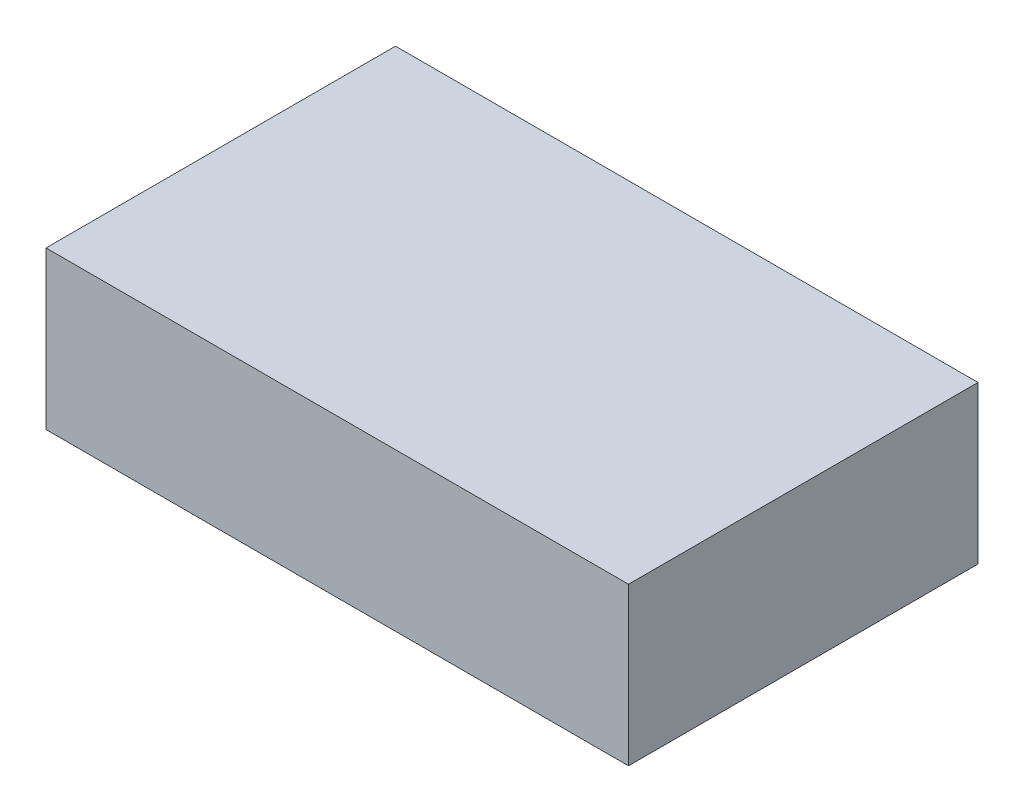
ISO-10303-21;
HEADER;
FILE_DESCRIPTION(('STEP AP214'),'2;1');
FILE_NAME('part.step','',(''),(''),'','','');
FILE_SCHEMA(('AUTOMOTIVE_DESIGN { 1 0 10303 214 1 1 1 1 }'));
ENDSEC;
DATA;
#1=APPLICATION_CONTEXT('core data for automotive mechanical design processes');
#2=APPLICATION_PROTOCOL_DEFINITION('international standard','automotive_design',2000,#1);
#3=PRODUCT_CONTEXT('',#1,'mechanical');
#4=PRODUCT('Part','Part','',(#3));
#5=PRODUCT_RELATED_PRODUCT_CATEGORY('part','',(#4));
#6=PRODUCT_DEFINITION_FORMATION('','',#4);
#7=PRODUCT_DEFINITION_CONTEXT('part definition',#1,'design');
#8=PRODUCT_DEFINITION('design','',#6,#7);
#9=PRODUCT_DEFINITION_SHAPE('','',#8);
#10=(LENGTH_UNIT() NAMED_UNIT(*) SI_UNIT(.MILLI.,.METRE.));
#11=(NAMED_UNIT(*) PLANE_ANGLE_UNIT() SI_UNIT($,.RADIAN.));
#12=(NAMED_UNIT(*) SI_UNIT($,.STERADIAN.) SOLID_ANGLE_UNIT());
#13=UNCERTAINTY_MEASURE_WITH_UNIT(LENGTH_MEASURE(1.E-05),#10,'distance_accuracy_value','');
#14=(GEOMETRIC_REPRESENTATION_CONTEXT(3) GLOBAL_UNCERTAINTY_ASSIGNED_CONTEXT((#13)) GLOBAL_UNIT_ASSIGNED_CONTEXT((#10,
#11,#12)) REPRESENTATION_CONTEXT('',''));
#15=CARTESIAN_POINT('',(0.,0.,0.));
#16=DIRECTION('',(0.,0.,1.));
#17=DIRECTION('',(1.,0.,0.));
#18=AXIS2_PLACEMENT_3D('',#15,#16,#17);
#19=CARTESIAN_POINT('',(5.,2.7,-3.));
#20=DIRECTION('',(-1.,0.,0.));
#21=DIRECTION('',(0.,0.,1.));
#22=AXIS2_PLACEMENT_3D('',#19,#20,#21);
#23=PLANE('',#22);
#24=DIRECTION('',(0.,0.,-1.));
#25=VECTOR('',#24,1.);
#26=CARTESIAN_POINT('',(5.,0.,-3.));
#27=LINE('',#26,#25);
#28=CARTESIAN_POINT('',(5.,0.,3.));
#29=VERTEX_POINT('',#28);
#30=CARTESIAN_POINT('',(5.,0.,-3.));
#31=VERTEX_POINT('',#30);
#32=EDGE_CURVE('E96',#29,#31,#27,.T.);
#33=ORIENTED_EDGE('',*,*,#32,.T.);
#34=DIRECTION('',(0.,-1.,0.));
#35=VECTOR('',#34,1.);
#36=CARTESIAN_POINT('',(5.,2.7,-3.));
#37=LINE('',#36,#35);
#38=CARTESIAN_POINT('',(5.,2.7,-3.));
#39=VERTEX_POINT('',#38);
#40=EDGE_CURVE('E11',#39,#31,#37,.T.);
#41=ORIENTED_EDGE('',*,*,#40,.F.);
#42=DIRECTION('',(0.,0.,-1.));
#43=VECTOR('',#42,1.);
#44=CARTESIAN_POINT('',(5.,2.7,-3.));
#45=LINE('',#44,#43);
#46=CARTESIAN_POINT('',(5.,2.7,3.));
#47=VERTEX_POINT('',#46);
#48=EDGE_CURVE('E84',#47,#39,#45,.T.);
#49=ORIENTED_EDGE('',*,*,#48,.F.);
#50=DIRECTION('',(0.,-1.,0.));
#51=VECTOR('',#50,1.);
#52=CARTESIAN_POINT('',(5.,2.7,3.));
#53=LINE('',#52,#51);
#54=EDGE_CURVE('E92',#47,#29,#53,.T.);
#55=ORIENTED_EDGE('',*,*,#54,.T.);
#56=EDGE_LOOP('',(#33,#41,#49,#55));
#57=FACE_BOUND('',#56,.T.);
#58=ADVANCED_FACE('F33',(#57),#23,.F.);
#59=CARTESIAN_POINT('',(-5.,2.7,-3.));
#60=DIRECTION('',(0.,0.,1.));
#61=DIRECTION('',(1.,0.,0.));
#62=AXIS2_PLACEMENT_3D('',#59,#60,#61);
#63=PLANE('',#62);
#64=DIRECTION('',(-1.,0.,0.));
#65=VECTOR('',#64,1.);
#66=CARTESIAN_POINT('',(-5.,0.,-3.));
#67=LINE('',#66,#65);
#68=CARTESIAN_POINT('',(-5.,0.,-3.));
#69=VERTEX_POINT('',#68);
#70=EDGE_CURVE('E88',#31,#69,#67,.T.);
#71=ORIENTED_EDGE('',*,*,#70,.T.);
#72=DIRECTION('',(0.,-1.,0.));
#73=VECTOR('',#72,1.);
#74=CARTESIAN_POINT('',(-5.,2.7,-3.));
#75=LINE('',#74,#73);
#76=CARTESIAN_POINT('',(-5.,2.7,-3.));
#77=VERTEX_POINT('',#76);
#78=EDGE_CURVE('E41',#77,#69,#75,.T.);
#79=ORIENTED_EDGE('',*,*,#78,.F.);
#80=DIRECTION('',(-1.,0.,0.));
#81=VECTOR('',#80,1.);
#82=CARTESIAN_POINT('',(-5.,2.7,-3.));
#83=LINE('',#82,#81);
#84=EDGE_CURVE('E79',#39,#77,#83,.T.);
#85=ORIENTED_EDGE('',*,*,#84,.F.);
#86=ORIENTED_EDGE('',*,*,#40,.T.);
#87=EDGE_LOOP('',(#71,#79,#85,#86));
#88=FACE_BOUND('',#87,.T.);
#89=ADVANCED_FACE('F87',(#88),#63,.F.);
#90=CARTESIAN_POINT('',(-5.,2.7,-3.));
#91=DIRECTION('',(1.,0.,0.));
#92=DIRECTION('',(0.,0.,-1.));
#93=AXIS2_PLACEMENT_3D('',#90,#91,#92);
#94=PLANE('',#93);
#95=DIRECTION('',(0.,0.,1.));
#96=VECTOR('',#95,1.);
#97=CARTESIAN_POINT('',(-5.,0.,-3.));
#98=LINE('',#97,#96);
#99=CARTESIAN_POINT('',(-5.,0.,3.));
#100=VERTEX_POINT('',#99);
#101=EDGE_CURVE('E66',#69,#100,#98,.T.);
#102=ORIENTED_EDGE('',*,*,#101,.T.);
#103=DIRECTION('',(0.,-1.,0.));
#104=VECTOR('',#103,1.);
#105=CARTESIAN_POINT('',(-5.,2.7,3.));
#106=LINE('',#105,#104);
#107=CARTESIAN_POINT('',(-5.,2.7,3.));
#108=VERTEX_POINT('',#107);
#109=EDGE_CURVE('E89',#108,#100,#106,.T.);
#110=ORIENTED_EDGE('',*,*,#109,.F.);
#111=DIRECTION('',(0.,0.,1.));
#112=VECTOR('',#111,1.);
#113=CARTESIAN_POINT('',(-5.,2.7,-3.));
#114=LINE('',#113,#112);
#115=EDGE_CURVE('E82',#77,#108,#114,.T.);
#116=ORIENTED_EDGE('',*,*,#115,.F.);
#117=ORIENTED_EDGE('',*,*,#78,.T.);
#118=EDGE_LOOP('',(#102,#110,#116,#117));
#119=FACE_BOUND('',#118,.T.);
#120=ADVANCED_FACE('F90',(#119),#94,.F.);
#121=CARTESIAN_POINT('',(-5.,2.7,3.));
#122=DIRECTION('',(0.,0.,-1.));
#123=DIRECTION('',(-1.,0.,0.));
#124=AXIS2_PLACEMENT_3D('',#121,#122,#123);
#125=PLANE('',#124);
#126=DIRECTION('',(1.,0.,0.));
#127=VECTOR('',#126,1.);
#128=CARTESIAN_POINT('',(-5.,0.,3.));
#129=LINE('',#128,#127);
#130=EDGE_CURVE('E72',#100,#29,#129,.T.);
#131=ORIENTED_EDGE('',*,*,#130,.T.);
#132=ORIENTED_EDGE('',*,*,#54,.F.);
#133=DIRECTION('',(1.,0.,0.));
#134=VECTOR('',#133,1.);
#135=CARTESIAN_POINT('',(-5.,2.7,3.));
#136=LINE('',#135,#134);
#137=EDGE_CURVE('E49',#108,#47,#136,.T.);
#138=ORIENTED_EDGE('',*,*,#137,.F.);
#139=ORIENTED_EDGE('',*,*,#109,.T.);
#140=EDGE_LOOP('',(#131,#132,#138,#139));
#141=FACE_BOUND('',#140,.T.);
#142=ADVANCED_FACE('F103',(#141),#125,.F.);
#143=CARTESIAN_POINT('',(0.,2.7,0.));
#144=DIRECTION('',(0.,1.,0.));
#145=DIRECTION('',(0.,0.,1.));
#146=AXIS2_PLACEMENT_3D('',#143,#144,#145);
#147=PLANE('',#146);
#148=ORIENTED_EDGE('',*,*,#48,.T.);
#149=ORIENTED_EDGE('',*,*,#84,.T.);
#150=ORIENTED_EDGE('',*,*,#115,.T.);
#151=ORIENTED_EDGE('',*,*,#137,.T.);
#152=EDGE_LOOP('',(#148,#149,#150,#151));
#153=FACE_BOUND('',#152,.T.);
#154=ADVANCED_FACE('F80',(#153),#147,.T.);
#155=CARTESIAN_POINT('',(0.,0.,0.));
#156=DIRECTION('',(0.,1.,0.));
#157=DIRECTION('',(0.,0.,1.));
#158=AXIS2_PLACEMENT_3D('',#155,#156,#157);
#159=PLANE('',#158);
#160=ORIENTED_EDGE('',*,*,#32,.F.);
#161=ORIENTED_EDGE('',*,*,#130,.F.);
#162=ORIENTED_EDGE('',*,*,#101,.F.);
#163=ORIENTED_EDGE('',*,*,#70,.F.);
#164=EDGE_LOOP('',(#160,#161,#162,#163));
#165=FACE_BOUND('',#164,.T.);
#166=ADVANCED_FACE('F106',(#165),#159,.F.);
#167=CLOSED_SHELL('',(#58,#89,#120,#142,#154,#166));
#168=MANIFOLD_SOLID_BREP('B2',#167);
#169=ADVANCED_BREP_SHAPE_REPRESENTATION('',(#18,#168),#14);
#170=SHAPE_DEFINITION_REPRESENTATION(#9,#169);
ENDSEC;
END-ISO-10303-21;
